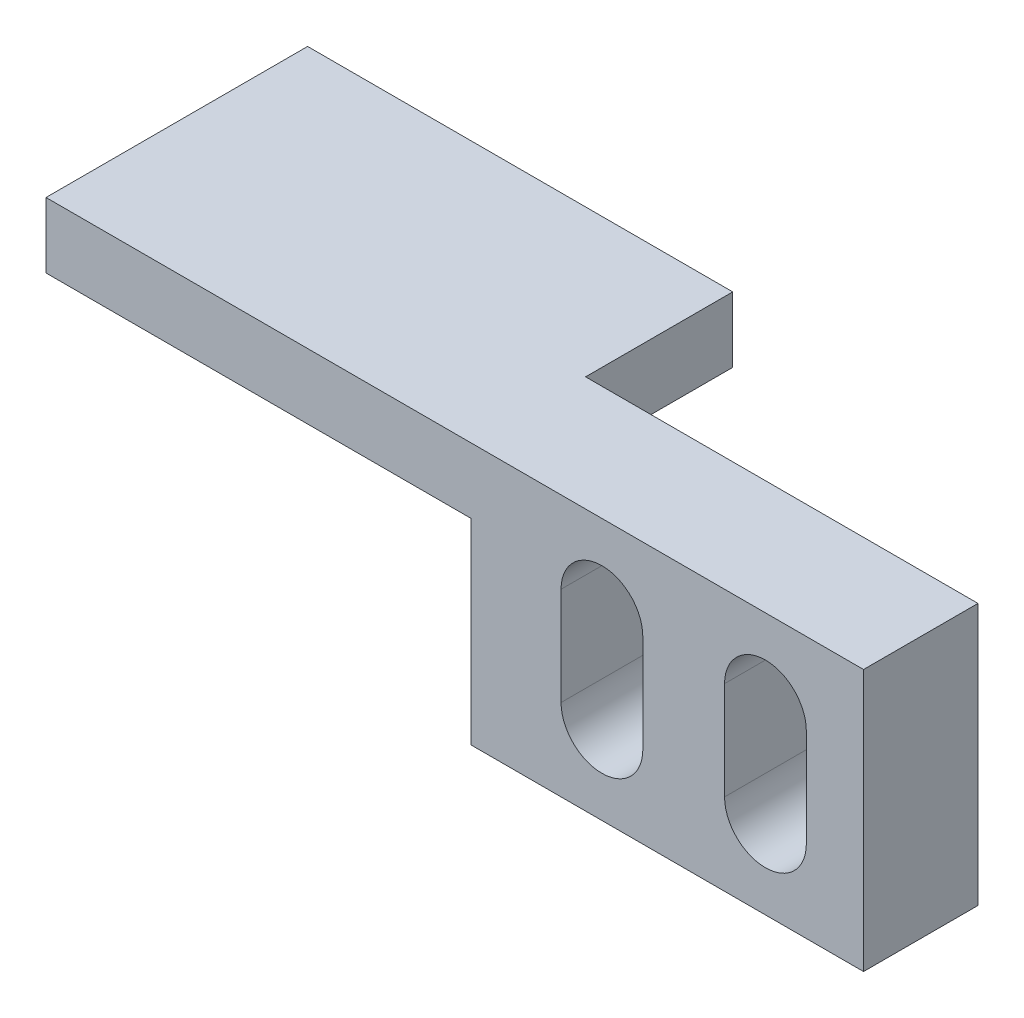
ISO-10303-21;
HEADER;
FILE_DESCRIPTION(('STEP AP214'),'2;1');
FILE_NAME('part.step','',(''),(''),'','','');
FILE_SCHEMA(('AUTOMOTIVE_DESIGN { 1 0 10303 214 1 1 1 1 }'));
ENDSEC;
DATA;
#1=APPLICATION_CONTEXT('core data for automotive mechanical design processes');
#2=APPLICATION_PROTOCOL_DEFINITION('international standard','automotive_design',2000,#1);
#3=PRODUCT_CONTEXT('',#1,'mechanical');
#4=PRODUCT('Part','Part','',(#3));
#5=PRODUCT_RELATED_PRODUCT_CATEGORY('part','',(#4));
#6=PRODUCT_DEFINITION_FORMATION('','',#4);
#7=PRODUCT_DEFINITION_CONTEXT('part definition',#1,'design');
#8=PRODUCT_DEFINITION('design','',#6,#7);
#9=PRODUCT_DEFINITION_SHAPE('','',#8);
#10=(LENGTH_UNIT() NAMED_UNIT(*) SI_UNIT(.MILLI.,.METRE.));
#11=(NAMED_UNIT(*) PLANE_ANGLE_UNIT() SI_UNIT($,.RADIAN.));
#12=(NAMED_UNIT(*) SI_UNIT($,.STERADIAN.) SOLID_ANGLE_UNIT());
#13=UNCERTAINTY_MEASURE_WITH_UNIT(LENGTH_MEASURE(1.E-05),#10,'distance_accuracy_value','');
#14=(GEOMETRIC_REPRESENTATION_CONTEXT(3) GLOBAL_UNCERTAINTY_ASSIGNED_CONTEXT((#13)) GLOBAL_UNIT_ASSIGNED_CONTEXT((#10,
#11,#12)) REPRESENTATION_CONTEXT('',''));
#15=CARTESIAN_POINT('',(0.,0.,0.));
#16=DIRECTION('',(0.,0.,1.));
#17=DIRECTION('',(1.,0.,0.));
#18=AXIS2_PLACEMENT_3D('',#15,#16,#17);
#19=CARTESIAN_POINT('',(0.,0.,3.5));
#20=DIRECTION('',(1.,0.,0.));
#21=DIRECTION('',(0.,0.,-1.));
#22=AXIS2_PLACEMENT_3D('',#19,#20,#21);
#23=PLANE('',#22);
#24=DIRECTION('',(0.,0.,1.));
#25=VECTOR('',#24,1.);
#26=CARTESIAN_POINT('',(0.,6.,0.));
#27=LINE('',#26,#25);
#28=CARTESIAN_POINT('',(0.,6.,0.));
#29=VERTEX_POINT('',#28);
#30=CARTESIAN_POINT('',(0.,6.,3.5));
#31=VERTEX_POINT('',#30);
#32=EDGE_CURVE('E166',#29,#31,#27,.T.);
#33=ORIENTED_EDGE('',*,*,#32,.F.);
#34=DIRECTION('',(0.,-1.,0.));
#35=VECTOR('',#34,1.);
#36=CARTESIAN_POINT('',(0.,0.,0.));
#37=LINE('',#36,#35);
#38=CARTESIAN_POINT('',(0.,0.,0.));
#39=VERTEX_POINT('',#38);
#40=EDGE_CURVE('E209',#29,#39,#37,.T.);
#41=ORIENTED_EDGE('',*,*,#40,.T.);
#42=DIRECTION('',(0.,0.,-1.));
#43=VECTOR('',#42,1.);
#44=CARTESIAN_POINT('',(0.,0.,3.5));
#45=LINE('',#44,#43);
#46=CARTESIAN_POINT('',(0.,0.,3.5));
#47=VERTEX_POINT('',#46);
#48=EDGE_CURVE('E11',#47,#39,#45,.T.);
#49=ORIENTED_EDGE('',*,*,#48,.F.);
#50=DIRECTION('',(0.,-1.,0.));
#51=VECTOR('',#50,1.);
#52=CARTESIAN_POINT('',(0.,0.,3.5));
#53=LINE('',#52,#51);
#54=EDGE_CURVE('E245',#31,#47,#53,.T.);
#55=ORIENTED_EDGE('',*,*,#54,.F.);
#56=EDGE_LOOP('',(#33,#41,#49,#55));
#57=FACE_BOUND('',#56,.T.);
#58=ADVANCED_FACE('F33',(#57),#23,.F.);
#59=CARTESIAN_POINT('',(0.,0.,3.5));
#60=DIRECTION('',(0.,1.,0.));
#61=DIRECTION('',(0.,0.,1.));
#62=AXIS2_PLACEMENT_3D('',#59,#60,#61);
#63=PLANE('',#62);
#64=DIRECTION('',(1.,0.,0.));
#65=VECTOR('',#64,1.);
#66=CARTESIAN_POINT('',(0.,0.,0.));
#67=LINE('',#66,#65);
#68=CARTESIAN_POINT('',(12.,0.,0.));
#69=VERTEX_POINT('',#68);
#70=EDGE_CURVE('E256',#39,#69,#67,.T.);
#71=ORIENTED_EDGE('',*,*,#70,.T.);
#72=DIRECTION('',(0.,0.,-1.));
#73=VECTOR('',#72,1.);
#74=CARTESIAN_POINT('',(12.,0.,3.5));
#75=LINE('',#74,#73);
#76=CARTESIAN_POINT('',(12.,0.,3.5));
#77=VERTEX_POINT('',#76);
#78=EDGE_CURVE('E40',#77,#69,#75,.T.);
#79=ORIENTED_EDGE('',*,*,#78,.F.);
#80=DIRECTION('',(1.,0.,0.));
#81=VECTOR('',#80,1.);
#82=CARTESIAN_POINT('',(0.,0.,3.5));
#83=LINE('',#82,#81);
#84=EDGE_CURVE('E247',#47,#77,#83,.T.);
#85=ORIENTED_EDGE('',*,*,#84,.F.);
#86=ORIENTED_EDGE('',*,*,#48,.T.);
#87=EDGE_LOOP('',(#71,#79,#85,#86));
#88=FACE_BOUND('',#87,.T.);
#89=ADVANCED_FACE('F286',(#88),#63,.F.);
#90=CARTESIAN_POINT('',(12.,0.,3.5));
#91=DIRECTION('',(-1.,0.,0.));
#92=DIRECTION('',(0.,0.,1.));
#93=AXIS2_PLACEMENT_3D('',#90,#91,#92);
#94=PLANE('',#93);
#95=DIRECTION('',(0.,1.,0.));
#96=VECTOR('',#95,1.);
#97=CARTESIAN_POINT('',(12.,0.,0.));
#98=LINE('',#97,#96);
#99=CARTESIAN_POINT('',(12.,8.,0.));
#100=VERTEX_POINT('',#99);
#101=EDGE_CURVE('E258',#69,#100,#98,.T.);
#102=ORIENTED_EDGE('',*,*,#101,.T.);
#103=DIRECTION('',(0.,0.,-1.));
#104=VECTOR('',#103,1.);
#105=CARTESIAN_POINT('',(12.,8.,3.5));
#106=LINE('',#105,#104);
#107=CARTESIAN_POINT('',(12.,8.,3.5));
#108=VERTEX_POINT('',#107);
#109=EDGE_CURVE('E254',#108,#100,#106,.T.);
#110=ORIENTED_EDGE('',*,*,#109,.F.);
#111=DIRECTION('',(0.,1.,0.));
#112=VECTOR('',#111,1.);
#113=CARTESIAN_POINT('',(12.,0.,3.5));
#114=LINE('',#113,#112);
#115=EDGE_CURVE('E250',#77,#108,#114,.T.);
#116=ORIENTED_EDGE('',*,*,#115,.F.);
#117=ORIENTED_EDGE('',*,*,#78,.T.);
#118=EDGE_LOOP('',(#102,#110,#116,#117));
#119=FACE_BOUND('',#118,.T.);
#120=ADVANCED_FACE('F267',(#119),#94,.F.);
#121=CARTESIAN_POINT('',(0.,8.,3.5));
#122=DIRECTION('',(0.,-1.,0.));
#123=DIRECTION('',(0.,0.,-1.));
#124=AXIS2_PLACEMENT_3D('',#121,#122,#123);
#125=PLANE('',#124);
#126=DIRECTION('',(-1.,0.,0.));
#127=VECTOR('',#126,1.);
#128=CARTESIAN_POINT('',(0.,8.,0.));
#129=LINE('',#128,#127);
#130=CARTESIAN_POINT('',(0.,8.,0.));
#131=VERTEX_POINT('',#130);
#132=EDGE_CURVE('E248',#100,#131,#129,.T.);
#133=ORIENTED_EDGE('',*,*,#132,.T.);
#134=DIRECTION('',(0.,0.,1.));
#135=VECTOR('',#134,1.);
#136=CARTESIAN_POINT('',(0.,8.,-4.5));
#137=LINE('',#136,#135);
#138=CARTESIAN_POINT('',(0.,8.,-4.5));
#139=VERTEX_POINT('',#138);
#140=EDGE_CURVE('E167',#139,#131,#137,.T.);
#141=ORIENTED_EDGE('',*,*,#140,.F.);
#142=DIRECTION('',(1.,0.,0.));
#143=VECTOR('',#142,1.);
#144=CARTESIAN_POINT('',(0.,8.,-4.5));
#145=LINE('',#144,#143);
#146=CARTESIAN_POINT('',(-13.,8.,-4.5));
#147=VERTEX_POINT('',#146);
#148=EDGE_CURVE('E160',#147,#139,#145,.T.);
#149=ORIENTED_EDGE('',*,*,#148,.F.);
#150=DIRECTION('',(0.,0.,-1.));
#151=VECTOR('',#150,1.);
#152=CARTESIAN_POINT('',(-13.,8.,0.));
#153=LINE('',#152,#151);
#154=CARTESIAN_POINT('',(-13.,8.,3.5));
#155=VERTEX_POINT('',#154);
#156=EDGE_CURVE('E177',#155,#147,#153,.T.);
#157=ORIENTED_EDGE('',*,*,#156,.F.);
#158=DIRECTION('',(-1.,0.,0.));
#159=VECTOR('',#158,1.);
#160=CARTESIAN_POINT('',(0.,8.,3.5));
#161=LINE('',#160,#159);
#162=EDGE_CURVE('E252',#108,#155,#161,.T.);
#163=ORIENTED_EDGE('',*,*,#162,.F.);
#164=ORIENTED_EDGE('',*,*,#109,.T.);
#165=EDGE_LOOP('',(#133,#141,#149,#157,#163,#164));
#166=FACE_BOUND('',#165,.T.);
#167=ADVANCED_FACE('F275',(#166),#125,.F.);
#168=CARTESIAN_POINT('',(0.,0.,3.5));
#169=DIRECTION('',(0.,0.,-1.));
#170=DIRECTION('',(-1.,0.,0.));
#171=AXIS2_PLACEMENT_3D('',#168,#169,#170);
#172=PLANE('',#171);
#173=DIRECTION('',(0.,-1.,0.));
#174=VECTOR('',#173,1.);
#175=CARTESIAN_POINT('',(2.75,5.5,3.5));
#176=LINE('',#175,#174);
#177=CARTESIAN_POINT('',(2.75,5.5,3.5));
#178=VERTEX_POINT('',#177);
#179=CARTESIAN_POINT('',(2.75,2.5,3.5));
#180=VERTEX_POINT('',#179);
#181=EDGE_CURVE('E198',#178,#180,#176,.T.);
#182=ORIENTED_EDGE('',*,*,#181,.F.);
#183=CARTESIAN_POINT('',(4.,5.5,3.5));
#184=DIRECTION('',(0.,0.,1.));
#185=DIRECTION('',(1.,0.,0.));
#186=AXIS2_PLACEMENT_3D('',#183,#184,#185);
#187=CIRCLE('',#186,1.25);
#188=CARTESIAN_POINT('',(5.25,5.5,3.5));
#189=VERTEX_POINT('',#188);
#190=EDGE_CURVE('E55',#189,#178,#187,.T.);
#191=ORIENTED_EDGE('',*,*,#190,.F.);
#192=DIRECTION('',(0.,1.,0.));
#193=VECTOR('',#192,1.);
#194=CARTESIAN_POINT('',(5.25,5.5,3.5));
#195=LINE('',#194,#193);
#196=CARTESIAN_POINT('',(5.25,2.5,3.5));
#197=VERTEX_POINT('',#196);
#198=EDGE_CURVE('E187',#197,#189,#195,.T.);
#199=ORIENTED_EDGE('',*,*,#198,.F.);
#200=CARTESIAN_POINT('',(4.,2.5,3.5));
#201=DIRECTION('',(0.,0.,1.));
#202=DIRECTION('',(1.,0.,0.));
#203=AXIS2_PLACEMENT_3D('',#200,#201,#202);
#204=CIRCLE('',#203,1.25);
#205=EDGE_CURVE('E202',#180,#197,#204,.T.);
#206=ORIENTED_EDGE('',*,*,#205,.F.);
#207=EDGE_LOOP('',(#182,#191,#199,#206));
#208=FACE_BOUND('',#207,.T.);
#209=DIRECTION('',(0.,-1.,0.));
#210=VECTOR('',#209,1.);
#211=CARTESIAN_POINT('',(7.75,5.5,3.5));
#212=LINE('',#211,#210);
#213=CARTESIAN_POINT('',(7.75,5.5,3.5));
#214=VERTEX_POINT('',#213);
#215=CARTESIAN_POINT('',(7.75,2.5,3.5));
#216=VERTEX_POINT('',#215);
#217=EDGE_CURVE('E230',#214,#216,#212,.T.);
#218=ORIENTED_EDGE('',*,*,#217,.F.);
#219=CARTESIAN_POINT('',(9.,5.5,3.5));
#220=DIRECTION('',(0.,0.,1.));
#221=DIRECTION('',(1.,0.,0.));
#222=AXIS2_PLACEMENT_3D('',#219,#220,#221);
#223=CIRCLE('',#222,1.25);
#224=CARTESIAN_POINT('',(10.25,5.5,3.5));
#225=VERTEX_POINT('',#224);
#226=EDGE_CURVE('E182',#225,#214,#223,.T.);
#227=ORIENTED_EDGE('',*,*,#226,.F.);
#228=DIRECTION('',(0.,1.,0.));
#229=VECTOR('',#228,1.);
#230=CARTESIAN_POINT('',(10.25,5.5,3.5));
#231=LINE('',#230,#229);
#232=CARTESIAN_POINT('',(10.25,2.5,3.5));
#233=VERTEX_POINT('',#232);
#234=EDGE_CURVE('E219',#233,#225,#231,.T.);
#235=ORIENTED_EDGE('',*,*,#234,.F.);
#236=CARTESIAN_POINT('',(9.,2.5,3.5));
#237=DIRECTION('',(0.,0.,1.));
#238=DIRECTION('',(1.,0.,0.));
#239=AXIS2_PLACEMENT_3D('',#236,#237,#238);
#240=CIRCLE('',#239,1.25);
#241=EDGE_CURVE('E233',#216,#233,#240,.T.);
#242=ORIENTED_EDGE('',*,*,#241,.F.);
#243=EDGE_LOOP('',(#218,#227,#235,#242));
#244=FACE_BOUND('',#243,.T.);
#245=ORIENTED_EDGE('',*,*,#162,.T.);
#246=DIRECTION('',(0.,1.,0.));
#247=VECTOR('',#246,1.);
#248=CARTESIAN_POINT('',(-13.,8.,3.5));
#249=LINE('',#248,#247);
#250=CARTESIAN_POINT('',(-13.,6.,3.5));
#251=VERTEX_POINT('',#250);
#252=EDGE_CURVE('E174',#251,#155,#249,.T.);
#253=ORIENTED_EDGE('',*,*,#252,.F.);
#254=DIRECTION('',(1.,0.,0.));
#255=VECTOR('',#254,1.);
#256=CARTESIAN_POINT('',(-13.,6.,3.5));
#257=LINE('',#256,#255);
#258=EDGE_CURVE('E178',#251,#31,#257,.T.);
#259=ORIENTED_EDGE('',*,*,#258,.T.);
#260=ORIENTED_EDGE('',*,*,#54,.T.);
#261=ORIENTED_EDGE('',*,*,#84,.T.);
#262=ORIENTED_EDGE('',*,*,#115,.T.);
#263=EDGE_LOOP('',(#245,#253,#259,#260,#261,#262));
#264=FACE_BOUND('',#263,.T.);
#265=ADVANCED_FACE('F280',(#208,#244,#264),#172,.F.);
#266=CARTESIAN_POINT('',(0.,0.,0.));
#267=DIRECTION('',(0.,0.,-1.));
#268=DIRECTION('',(-1.,0.,0.));
#269=AXIS2_PLACEMENT_3D('',#266,#267,#268);
#270=PLANE('',#269);
#271=DIRECTION('',(0.,-1.,0.));
#272=VECTOR('',#271,1.);
#273=CARTESIAN_POINT('',(0.,6.,0.));
#274=LINE('',#273,#272);
#275=EDGE_CURVE('E47',#131,#29,#274,.T.);
#276=ORIENTED_EDGE('',*,*,#275,.F.);
#277=ORIENTED_EDGE('',*,*,#132,.F.);
#278=ORIENTED_EDGE('',*,*,#101,.F.);
#279=ORIENTED_EDGE('',*,*,#70,.F.);
#280=ORIENTED_EDGE('',*,*,#40,.F.);
#281=EDGE_LOOP('',(#276,#277,#278,#279,#280));
#282=FACE_BOUND('',#281,.T.);
#283=CARTESIAN_POINT('',(4.,5.5,0.));
#284=DIRECTION('',(0.,0.,1.));
#285=DIRECTION('',(1.,0.,0.));
#286=AXIS2_PLACEMENT_3D('',#283,#284,#285);
#287=CIRCLE('',#286,1.25);
#288=CARTESIAN_POINT('',(5.25,5.5,0.));
#289=VERTEX_POINT('',#288);
#290=CARTESIAN_POINT('',(2.75,5.5,0.));
#291=VERTEX_POINT('',#290);
#292=EDGE_CURVE('E183',#289,#291,#287,.T.);
#293=ORIENTED_EDGE('',*,*,#292,.T.);
#294=DIRECTION('',(0.,-1.,0.));
#295=VECTOR('',#294,1.);
#296=CARTESIAN_POINT('',(2.75,5.5,0.));
#297=LINE('',#296,#295);
#298=CARTESIAN_POINT('',(2.75,2.5,0.));
#299=VERTEX_POINT('',#298);
#300=EDGE_CURVE('E186',#291,#299,#297,.T.);
#301=ORIENTED_EDGE('',*,*,#300,.T.);
#302=CARTESIAN_POINT('',(4.,2.5,0.));
#303=DIRECTION('',(0.,0.,1.));
#304=DIRECTION('',(1.,0.,0.));
#305=AXIS2_PLACEMENT_3D('',#302,#303,#304);
#306=CIRCLE('',#305,1.25);
#307=CARTESIAN_POINT('',(5.25,2.5,0.));
#308=VERTEX_POINT('',#307);
#309=EDGE_CURVE('E190',#299,#308,#306,.T.);
#310=ORIENTED_EDGE('',*,*,#309,.T.);
#311=DIRECTION('',(0.,1.,0.));
#312=VECTOR('',#311,1.);
#313=CARTESIAN_POINT('',(5.25,5.5,0.));
#314=LINE('',#313,#312);
#315=EDGE_CURVE('E193',#308,#289,#314,.T.);
#316=ORIENTED_EDGE('',*,*,#315,.T.);
#317=EDGE_LOOP('',(#293,#301,#310,#316));
#318=FACE_BOUND('',#317,.T.);
#319=CARTESIAN_POINT('',(9.,5.5,0.));
#320=DIRECTION('',(0.,0.,1.));
#321=DIRECTION('',(1.,0.,0.));
#322=AXIS2_PLACEMENT_3D('',#319,#320,#321);
#323=CIRCLE('',#322,1.25);
#324=CARTESIAN_POINT('',(10.25,5.5,0.));
#325=VERTEX_POINT('',#324);
#326=CARTESIAN_POINT('',(7.75,5.5,0.));
#327=VERTEX_POINT('',#326);
#328=EDGE_CURVE('E215',#325,#327,#323,.T.);
#329=ORIENTED_EDGE('',*,*,#328,.T.);
#330=DIRECTION('',(0.,-1.,0.));
#331=VECTOR('',#330,1.);
#332=CARTESIAN_POINT('',(7.75,5.5,0.));
#333=LINE('',#332,#331);
#334=CARTESIAN_POINT('',(7.75,2.5,0.));
#335=VERTEX_POINT('',#334);
#336=EDGE_CURVE('E218',#327,#335,#333,.T.);
#337=ORIENTED_EDGE('',*,*,#336,.T.);
#338=CARTESIAN_POINT('',(9.,2.5,0.));
#339=DIRECTION('',(0.,0.,1.));
#340=DIRECTION('',(1.,0.,0.));
#341=AXIS2_PLACEMENT_3D('',#338,#339,#340);
#342=CIRCLE('',#341,1.25);
#343=CARTESIAN_POINT('',(10.25,2.5,0.));
#344=VERTEX_POINT('',#343);
#345=EDGE_CURVE('E222',#335,#344,#342,.T.);
#346=ORIENTED_EDGE('',*,*,#345,.T.);
#347=DIRECTION('',(0.,1.,0.));
#348=VECTOR('',#347,1.);
#349=CARTESIAN_POINT('',(10.25,5.5,0.));
#350=LINE('',#349,#348);
#351=EDGE_CURVE('E225',#344,#325,#350,.T.);
#352=ORIENTED_EDGE('',*,*,#351,.T.);
#353=EDGE_LOOP('',(#329,#337,#346,#352));
#354=FACE_BOUND('',#353,.T.);
#355=ADVANCED_FACE('F272',(#282,#318,#354),#270,.T.);
#356=CARTESIAN_POINT('',(9.,5.5,0.));
#357=DIRECTION('',(0.,0.,1.));
#358=DIRECTION('',(1.,0.,0.));
#359=AXIS2_PLACEMENT_3D('',#356,#357,#358);
#360=CYLINDRICAL_SURFACE('',#359,1.25);
#361=ORIENTED_EDGE('',*,*,#226,.T.);
#362=DIRECTION('',(0.,0.,1.));
#363=VECTOR('',#362,1.);
#364=CARTESIAN_POINT('',(7.75,5.5,0.));
#365=LINE('',#364,#363);
#366=EDGE_CURVE('E228',#327,#214,#365,.T.);
#367=ORIENTED_EDGE('',*,*,#366,.F.);
#368=ORIENTED_EDGE('',*,*,#328,.F.);
#369=DIRECTION('',(0.,0.,1.));
#370=VECTOR('',#369,1.);
#371=CARTESIAN_POINT('',(10.25,5.5,0.));
#372=LINE('',#371,#370);
#373=EDGE_CURVE('E199',#325,#225,#372,.T.);
#374=ORIENTED_EDGE('',*,*,#373,.T.);
#375=EDGE_LOOP('',(#361,#367,#368,#374));
#376=FACE_BOUND('',#375,.T.);
#377=ADVANCED_FACE('F300',(#376),#360,.F.);
#378=CARTESIAN_POINT('',(10.25,5.5,0.));
#379=DIRECTION('',(1.,0.,0.));
#380=DIRECTION('',(0.,0.,-1.));
#381=AXIS2_PLACEMENT_3D('',#378,#379,#380);
#382=PLANE('',#381);
#383=ORIENTED_EDGE('',*,*,#234,.T.);
#384=ORIENTED_EDGE('',*,*,#373,.F.);
#385=ORIENTED_EDGE('',*,*,#351,.F.);
#386=DIRECTION('',(0.,0.,1.));
#387=VECTOR('',#386,1.);
#388=CARTESIAN_POINT('',(10.25,2.5,0.));
#389=LINE('',#388,#387);
#390=EDGE_CURVE('E239',#344,#233,#389,.T.);
#391=ORIENTED_EDGE('',*,*,#390,.T.);
#392=EDGE_LOOP('',(#383,#384,#385,#391));
#393=FACE_BOUND('',#392,.T.);
#394=ADVANCED_FACE('F306',(#393),#382,.F.);
#395=CARTESIAN_POINT('',(9.,2.5,0.));
#396=DIRECTION('',(0.,0.,1.));
#397=DIRECTION('',(1.,0.,0.));
#398=AXIS2_PLACEMENT_3D('',#395,#396,#397);
#399=CYLINDRICAL_SURFACE('',#398,1.25);
#400=ORIENTED_EDGE('',*,*,#241,.T.);
#401=ORIENTED_EDGE('',*,*,#390,.F.);
#402=ORIENTED_EDGE('',*,*,#345,.F.);
#403=DIRECTION('',(0.,0.,1.));
#404=VECTOR('',#403,1.);
#405=CARTESIAN_POINT('',(7.75,2.5,0.));
#406=LINE('',#405,#404);
#407=EDGE_CURVE('E241',#335,#216,#406,.T.);
#408=ORIENTED_EDGE('',*,*,#407,.T.);
#409=EDGE_LOOP('',(#400,#401,#402,#408));
#410=FACE_BOUND('',#409,.T.);
#411=ADVANCED_FACE('F312',(#410),#399,.F.);
#412=CARTESIAN_POINT('',(7.75,5.5,0.));
#413=DIRECTION('',(-1.,0.,0.));
#414=DIRECTION('',(0.,-1.,0.));
#415=AXIS2_PLACEMENT_3D('',#412,#413,#414);
#416=PLANE('',#415);
#417=ORIENTED_EDGE('',*,*,#217,.T.);
#418=ORIENTED_EDGE('',*,*,#407,.F.);
#419=ORIENTED_EDGE('',*,*,#336,.F.);
#420=ORIENTED_EDGE('',*,*,#366,.T.);
#421=EDGE_LOOP('',(#417,#418,#419,#420));
#422=FACE_BOUND('',#421,.T.);
#423=ADVANCED_FACE('F308',(#422),#416,.F.);
#424=CARTESIAN_POINT('',(4.,5.5,0.));
#425=DIRECTION('',(0.,0.,1.));
#426=DIRECTION('',(1.,0.,0.));
#427=AXIS2_PLACEMENT_3D('',#424,#425,#426);
#428=CYLINDRICAL_SURFACE('',#427,1.25);
#429=ORIENTED_EDGE('',*,*,#190,.T.);
#430=DIRECTION('',(0.,0.,1.));
#431=VECTOR('',#430,1.);
#432=CARTESIAN_POINT('',(2.75,5.5,0.));
#433=LINE('',#432,#431);
#434=EDGE_CURVE('E196',#291,#178,#433,.T.);
#435=ORIENTED_EDGE('',*,*,#434,.F.);
#436=ORIENTED_EDGE('',*,*,#292,.F.);
#437=DIRECTION('',(0.,0.,1.));
#438=VECTOR('',#437,1.);
#439=CARTESIAN_POINT('',(5.25,5.5,0.));
#440=LINE('',#439,#438);
#441=EDGE_CURVE('E207',#289,#189,#440,.T.);
#442=ORIENTED_EDGE('',*,*,#441,.T.);
#443=EDGE_LOOP('',(#429,#435,#436,#442));
#444=FACE_BOUND('',#443,.T.);
#445=ADVANCED_FACE('F311',(#444),#428,.F.);
#446=CARTESIAN_POINT('',(5.25,5.5,0.));
#447=DIRECTION('',(1.,0.,0.));
#448=DIRECTION('',(0.,0.,-1.));
#449=AXIS2_PLACEMENT_3D('',#446,#447,#448);
#450=PLANE('',#449);
#451=ORIENTED_EDGE('',*,*,#198,.T.);
#452=ORIENTED_EDGE('',*,*,#441,.F.);
#453=ORIENTED_EDGE('',*,*,#315,.F.);
#454=DIRECTION('',(0.,0.,1.));
#455=VECTOR('',#454,1.);
#456=CARTESIAN_POINT('',(5.25,2.5,0.));
#457=LINE('',#456,#455);
#458=EDGE_CURVE('E210',#308,#197,#457,.T.);
#459=ORIENTED_EDGE('',*,*,#458,.T.);
#460=EDGE_LOOP('',(#451,#452,#453,#459));
#461=FACE_BOUND('',#460,.T.);
#462=ADVANCED_FACE('F322',(#461),#450,.F.);
#463=CARTESIAN_POINT('',(4.,2.5,0.));
#464=DIRECTION('',(0.,0.,1.));
#465=DIRECTION('',(1.,0.,0.));
#466=AXIS2_PLACEMENT_3D('',#463,#464,#465);
#467=CYLINDRICAL_SURFACE('',#466,1.25);
#468=ORIENTED_EDGE('',*,*,#205,.T.);
#469=ORIENTED_EDGE('',*,*,#458,.F.);
#470=ORIENTED_EDGE('',*,*,#309,.F.);
#471=DIRECTION('',(0.,0.,1.));
#472=VECTOR('',#471,1.);
#473=CARTESIAN_POINT('',(2.75,2.5,0.));
#474=LINE('',#473,#472);
#475=EDGE_CURVE('E212',#299,#180,#474,.T.);
#476=ORIENTED_EDGE('',*,*,#475,.T.);
#477=EDGE_LOOP('',(#468,#469,#470,#476));
#478=FACE_BOUND('',#477,.T.);
#479=ADVANCED_FACE('F326',(#478),#467,.F.);
#480=CARTESIAN_POINT('',(2.75,5.5,0.));
#481=DIRECTION('',(-1.,0.,0.));
#482=DIRECTION('',(0.,-1.,0.));
#483=AXIS2_PLACEMENT_3D('',#480,#481,#482);
#484=PLANE('',#483);
#485=ORIENTED_EDGE('',*,*,#181,.T.);
#486=ORIENTED_EDGE('',*,*,#475,.F.);
#487=ORIENTED_EDGE('',*,*,#300,.F.);
#488=ORIENTED_EDGE('',*,*,#434,.T.);
#489=EDGE_LOOP('',(#485,#486,#487,#488));
#490=FACE_BOUND('',#489,.T.);
#491=ADVANCED_FACE('F323',(#490),#484,.F.);
#492=CARTESIAN_POINT('',(-13.,6.,0.));
#493=DIRECTION('',(0.,1.,0.));
#494=DIRECTION('',(0.,0.,1.));
#495=AXIS2_PLACEMENT_3D('',#492,#493,#494);
#496=PLANE('',#495);
#497=ORIENTED_EDGE('',*,*,#32,.T.);
#498=ORIENTED_EDGE('',*,*,#258,.F.);
#499=DIRECTION('',(0.,0.,1.));
#500=VECTOR('',#499,1.);
#501=CARTESIAN_POINT('',(-13.,6.,0.));
#502=LINE('',#501,#500);
#503=CARTESIAN_POINT('',(-13.,6.,-4.5));
#504=VERTEX_POINT('',#503);
#505=EDGE_CURVE('E150',#504,#251,#502,.T.);
#506=ORIENTED_EDGE('',*,*,#505,.F.);
#507=DIRECTION('',(-1.,0.,0.));
#508=VECTOR('',#507,1.);
#509=CARTESIAN_POINT('',(0.,6.,-4.5));
#510=LINE('',#509,#508);
#511=CARTESIAN_POINT('',(0.,6.,-4.5));
#512=VERTEX_POINT('',#511);
#513=EDGE_CURVE('E143',#512,#504,#510,.T.);
#514=ORIENTED_EDGE('',*,*,#513,.F.);
#515=DIRECTION('',(0.,0.,1.));
#516=VECTOR('',#515,1.);
#517=CARTESIAN_POINT('',(0.,6.,-4.5));
#518=LINE('',#517,#516);
#519=EDGE_CURVE('E148',#512,#29,#518,.T.);
#520=ORIENTED_EDGE('',*,*,#519,.T.);
#521=EDGE_LOOP('',(#497,#498,#506,#514,#520));
#522=FACE_BOUND('',#521,.T.);
#523=ADVANCED_FACE('F146',(#522),#496,.F.);
#524=CARTESIAN_POINT('',(-13.,0.,0.));
#525=DIRECTION('',(-1.,0.,0.));
#526=DIRECTION('',(0.,0.,1.));
#527=AXIS2_PLACEMENT_3D('',#524,#525,#526);
#528=PLANE('',#527);
#529=ORIENTED_EDGE('',*,*,#156,.T.);
#530=DIRECTION('',(0.,1.,0.));
#531=VECTOR('',#530,1.);
#532=CARTESIAN_POINT('',(-13.,6.,-4.5));
#533=LINE('',#532,#531);
#534=EDGE_CURVE('E154',#504,#147,#533,.T.);
#535=ORIENTED_EDGE('',*,*,#534,.F.);
#536=ORIENTED_EDGE('',*,*,#505,.T.);
#537=ORIENTED_EDGE('',*,*,#252,.T.);
#538=EDGE_LOOP('',(#529,#535,#536,#537));
#539=FACE_BOUND('',#538,.T.);
#540=ADVANCED_FACE('F282',(#539),#528,.T.);
#541=CARTESIAN_POINT('',(0.,6.,-4.5));
#542=DIRECTION('',(-1.,0.,0.));
#543=DIRECTION('',(0.,0.,1.));
#544=AXIS2_PLACEMENT_3D('',#541,#542,#543);
#545=PLANE('',#544);
#546=ORIENTED_EDGE('',*,*,#275,.T.);
#547=ORIENTED_EDGE('',*,*,#519,.F.);
#548=DIRECTION('',(0.,-1.,0.));
#549=VECTOR('',#548,1.);
#550=CARTESIAN_POINT('',(0.,6.,-4.5));
#551=LINE('',#550,#549);
#552=EDGE_CURVE('E155',#139,#512,#551,.T.);
#553=ORIENTED_EDGE('',*,*,#552,.F.);
#554=ORIENTED_EDGE('',*,*,#140,.T.);
#555=EDGE_LOOP('',(#546,#547,#553,#554));
#556=FACE_BOUND('',#555,.T.);
#557=ADVANCED_FACE('F165',(#556),#545,.F.);
#558=CARTESIAN_POINT('',(0.,0.,-4.5));
#559=DIRECTION('',(0.,0.,1.));
#560=DIRECTION('',(1.,0.,0.));
#561=AXIS2_PLACEMENT_3D('',#558,#559,#560);
#562=PLANE('',#561);
#563=ORIENTED_EDGE('',*,*,#552,.T.);
#564=ORIENTED_EDGE('',*,*,#513,.T.);
#565=ORIENTED_EDGE('',*,*,#534,.T.);
#566=ORIENTED_EDGE('',*,*,#148,.T.);
#567=EDGE_LOOP('',(#563,#564,#565,#566));
#568=FACE_BOUND('',#567,.T.);
#569=ADVANCED_FACE('F158',(#568),#562,.F.);
#570=CLOSED_SHELL('',(#58,#89,#120,#167,#265,#355,#377,#394,#411,#423,#445,#462,#479,#491,#523,
#540,#557,#569));
#571=MANIFOLD_SOLID_BREP('B2',#570);
#572=ADVANCED_BREP_SHAPE_REPRESENTATION('',(#18,#571),#14);
#573=SHAPE_DEFINITION_REPRESENTATION(#9,#572);
ENDSEC;
END-ISO-10303-21;
